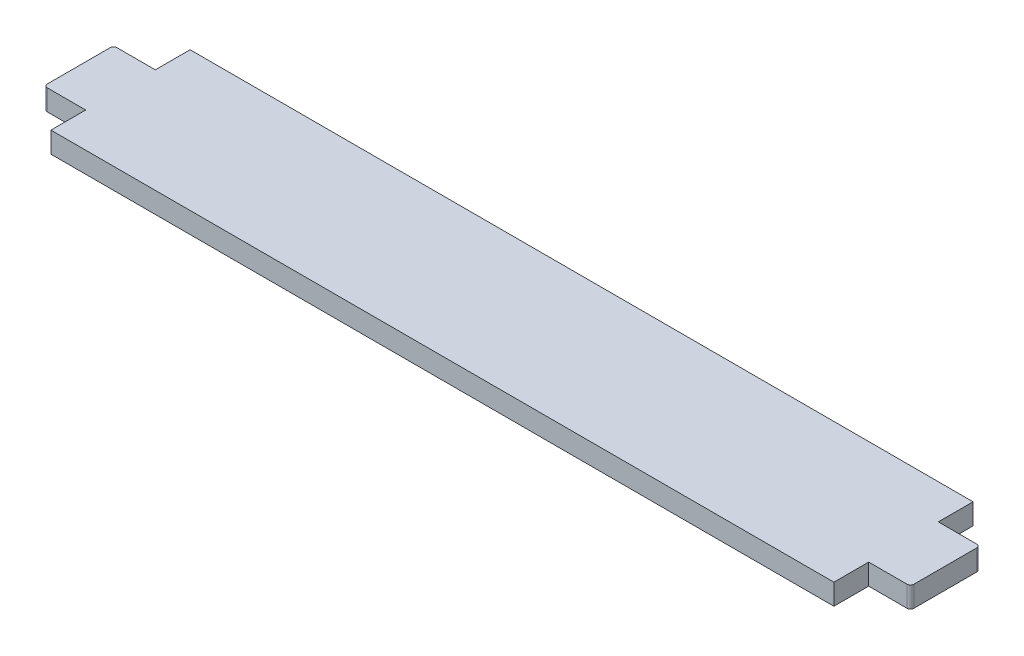
ISO-10303-21;
HEADER;
FILE_DESCRIPTION(('STEP AP214'),'2;1');
FILE_NAME('part.step','',(''),(''),'','','');
FILE_SCHEMA(('AUTOMOTIVE_DESIGN { 1 0 10303 214 1 1 1 1 }'));
ENDSEC;
DATA;
#1=APPLICATION_CONTEXT('core data for automotive mechanical design processes');
#2=APPLICATION_PROTOCOL_DEFINITION('international standard','automotive_design',2000,#1);
#3=PRODUCT_CONTEXT('',#1,'mechanical');
#4=PRODUCT('Part','Part','',(#3));
#5=PRODUCT_RELATED_PRODUCT_CATEGORY('part','',(#4));
#6=PRODUCT_DEFINITION_FORMATION('','',#4);
#7=PRODUCT_DEFINITION_CONTEXT('part definition',#1,'design');
#8=PRODUCT_DEFINITION('design','',#6,#7);
#9=PRODUCT_DEFINITION_SHAPE('','',#8);
#10=(LENGTH_UNIT() NAMED_UNIT(*) SI_UNIT(.MILLI.,.METRE.));
#11=(NAMED_UNIT(*) PLANE_ANGLE_UNIT() SI_UNIT($,.RADIAN.));
#12=(NAMED_UNIT(*) SI_UNIT($,.STERADIAN.) SOLID_ANGLE_UNIT());
#13=UNCERTAINTY_MEASURE_WITH_UNIT(LENGTH_MEASURE(1.E-05),#10,'distance_accuracy_value','');
#14=(GEOMETRIC_REPRESENTATION_CONTEXT(3) GLOBAL_UNCERTAINTY_ASSIGNED_CONTEXT((#13)) GLOBAL_UNIT_ASSIGNED_CONTEXT((#10,
#11,#12)) REPRESENTATION_CONTEXT('',''));
#15=CARTESIAN_POINT('',(0.,0.,0.));
#16=DIRECTION('',(0.,0.,1.));
#17=DIRECTION('',(1.,0.,0.));
#18=AXIS2_PLACEMENT_3D('',#15,#16,#17);
#19=CARTESIAN_POINT('',(0.,3.,4.99999999999999));
#20=DIRECTION('',(0.,0.,1.));
#21=DIRECTION('',(1.,0.,0.));
#22=AXIS2_PLACEMENT_3D('',#19,#20,#21);
#23=PLANE('',#22);
#24=DIRECTION('',(-1.,0.,0.));
#25=VECTOR('',#24,1.);
#26=CARTESIAN_POINT('',(0.,3.,4.99999999999999));
#27=LINE('',#26,#25);
#28=CARTESIAN_POINT('',(-56.25,3.,4.99999999999999));
#29=VERTEX_POINT('',#28);
#30=CARTESIAN_POINT('',(-61.75,3.,4.99999999999999));
#31=VERTEX_POINT('',#30);
#32=EDGE_CURVE('E162',#29,#31,#27,.T.);
#33=ORIENTED_EDGE('',*,*,#32,.T.);
#34=DIRECTION('',(0.,-1.,0.));
#35=VECTOR('',#34,1.);
#36=CARTESIAN_POINT('',(-61.75,0.,4.99999999999999));
#37=LINE('',#36,#35);
#38=CARTESIAN_POINT('',(-61.75,0.,4.99999999999999));
#39=VERTEX_POINT('',#38);
#40=EDGE_CURVE('E305',#31,#39,#37,.T.);
#41=ORIENTED_EDGE('',*,*,#40,.T.);
#42=DIRECTION('',(-1.,0.,0.));
#43=VECTOR('',#42,1.);
#44=CARTESIAN_POINT('',(0.,0.,4.99999999999999));
#45=LINE('',#44,#43);
#46=CARTESIAN_POINT('',(-56.25,0.,4.99999999999999));
#47=VERTEX_POINT('',#46);
#48=EDGE_CURVE('E165',#47,#39,#45,.T.);
#49=ORIENTED_EDGE('',*,*,#48,.F.);
#50=DIRECTION('',(0.,-1.,0.));
#51=VECTOR('',#50,1.);
#52=CARTESIAN_POINT('',(-56.25,3.,4.99999999999999));
#53=LINE('',#52,#51);
#54=EDGE_CURVE('E158',#29,#47,#53,.T.);
#55=ORIENTED_EDGE('',*,*,#54,.F.);
#56=EDGE_LOOP('',(#33,#41,#49,#55));
#57=FACE_BOUND('',#56,.T.);
#58=ADVANCED_FACE('F43',(#57),#23,.T.);
#59=CARTESIAN_POINT('',(-56.25,3.,0.));
#60=DIRECTION('',(1.,0.,0.));
#61=DIRECTION('',(0.,0.,-1.));
#62=AXIS2_PLACEMENT_3D('',#59,#60,#61);
#63=PLANE('',#62);
#64=DIRECTION('',(0.,0.,1.));
#65=VECTOR('',#64,1.);
#66=CARTESIAN_POINT('',(-56.25,0.,0.));
#67=LINE('',#66,#65);
#68=CARTESIAN_POINT('',(-56.25,0.,10.));
#69=VERTEX_POINT('',#68);
#70=EDGE_CURVE('E223',#47,#69,#67,.T.);
#71=ORIENTED_EDGE('',*,*,#70,.T.);
#72=DIRECTION('',(0.,-1.,0.));
#73=VECTOR('',#72,1.);
#74=CARTESIAN_POINT('',(-56.25,3.,10.));
#75=LINE('',#74,#73);
#76=CARTESIAN_POINT('',(-56.25,3.,10.));
#77=VERTEX_POINT('',#76);
#78=EDGE_CURVE('E170',#77,#69,#75,.T.);
#79=ORIENTED_EDGE('',*,*,#78,.F.);
#80=DIRECTION('',(0.,0.,1.));
#81=VECTOR('',#80,1.);
#82=CARTESIAN_POINT('',(-56.25,3.,0.));
#83=LINE('',#82,#81);
#84=EDGE_CURVE('E173',#29,#77,#83,.T.);
#85=ORIENTED_EDGE('',*,*,#84,.F.);
#86=ORIENTED_EDGE('',*,*,#54,.T.);
#87=EDGE_LOOP('',(#71,#79,#85,#86));
#88=FACE_BOUND('',#87,.T.);
#89=ADVANCED_FACE('F174',(#88),#63,.F.);
#90=CARTESIAN_POINT('',(0.,3.,10.));
#91=DIRECTION('',(0.,0.,-1.));
#92=DIRECTION('',(-1.,0.,0.));
#93=AXIS2_PLACEMENT_3D('',#90,#91,#92);
#94=PLANE('',#93);
#95=DIRECTION('',(1.,0.,0.));
#96=VECTOR('',#95,1.);
#97=CARTESIAN_POINT('',(0.,0.,10.));
#98=LINE('',#97,#96);
#99=CARTESIAN_POINT('',(56.25,0.,10.));
#100=VERTEX_POINT('',#99);
#101=EDGE_CURVE('E226',#69,#100,#98,.T.);
#102=ORIENTED_EDGE('',*,*,#101,.T.);
#103=DIRECTION('',(0.,-1.,0.));
#104=VECTOR('',#103,1.);
#105=CARTESIAN_POINT('',(56.25,3.,10.));
#106=LINE('',#105,#104);
#107=CARTESIAN_POINT('',(56.25,3.,10.));
#108=VERTEX_POINT('',#107);
#109=EDGE_CURVE('E270',#108,#100,#106,.T.);
#110=ORIENTED_EDGE('',*,*,#109,.F.);
#111=DIRECTION('',(1.,0.,0.));
#112=VECTOR('',#111,1.);
#113=CARTESIAN_POINT('',(0.,3.,10.));
#114=LINE('',#113,#112);
#115=EDGE_CURVE('E178',#77,#108,#114,.T.);
#116=ORIENTED_EDGE('',*,*,#115,.F.);
#117=ORIENTED_EDGE('',*,*,#78,.T.);
#118=EDGE_LOOP('',(#102,#110,#116,#117));
#119=FACE_BOUND('',#118,.T.);
#120=ADVANCED_FACE('F358',(#119),#94,.F.);
#121=CARTESIAN_POINT('',(56.25,3.,0.));
#122=DIRECTION('',(1.,0.,0.));
#123=DIRECTION('',(0.,0.,-1.));
#124=AXIS2_PLACEMENT_3D('',#121,#122,#123);
#125=PLANE('',#124);
#126=DIRECTION('',(0.,0.,1.));
#127=VECTOR('',#126,1.);
#128=CARTESIAN_POINT('',(56.25,0.,0.));
#129=LINE('',#128,#127);
#130=CARTESIAN_POINT('',(56.25,0.,4.99999999999999));
#131=VERTEX_POINT('',#130);
#132=EDGE_CURVE('E231',#131,#100,#129,.T.);
#133=ORIENTED_EDGE('',*,*,#132,.F.);
#134=DIRECTION('',(0.,-1.,0.));
#135=VECTOR('',#134,1.);
#136=CARTESIAN_POINT('',(56.25,3.,4.99999999999999));
#137=LINE('',#136,#135);
#138=CARTESIAN_POINT('',(56.25,3.,4.99999999999999));
#139=VERTEX_POINT('',#138);
#140=EDGE_CURVE('E267',#139,#131,#137,.T.);
#141=ORIENTED_EDGE('',*,*,#140,.F.);
#142=DIRECTION('',(0.,0.,1.));
#143=VECTOR('',#142,1.);
#144=CARTESIAN_POINT('',(56.25,3.,0.));
#145=LINE('',#144,#143);
#146=EDGE_CURVE('E196',#139,#108,#145,.T.);
#147=ORIENTED_EDGE('',*,*,#146,.T.);
#148=ORIENTED_EDGE('',*,*,#109,.T.);
#149=EDGE_LOOP('',(#133,#141,#147,#148));
#150=FACE_BOUND('',#149,.T.);
#151=ADVANCED_FACE('F364',(#150),#125,.T.);
#152=CARTESIAN_POINT('',(0.,3.,4.99999999999999));
#153=DIRECTION('',(0.,0.,-1.));
#154=DIRECTION('',(-1.,0.,0.));
#155=AXIS2_PLACEMENT_3D('',#152,#153,#154);
#156=PLANE('',#155);
#157=DIRECTION('',(1.,0.,0.));
#158=VECTOR('',#157,1.);
#159=CARTESIAN_POINT('',(0.,0.,4.99999999999999));
#160=LINE('',#159,#158);
#161=CARTESIAN_POINT('',(61.75,0.,4.99999999999999));
#162=VERTEX_POINT('',#161);
#163=EDGE_CURVE('E235',#131,#162,#160,.T.);
#164=ORIENTED_EDGE('',*,*,#163,.T.);
#165=DIRECTION('',(0.,-1.,0.));
#166=VECTOR('',#165,1.);
#167=CARTESIAN_POINT('',(61.75,3.,4.99999999999999));
#168=LINE('',#167,#166);
#169=CARTESIAN_POINT('',(61.75,3.,4.99999999999999));
#170=VERTEX_POINT('',#169);
#171=EDGE_CURVE('E11',#162,#170,#168,.F.);
#172=ORIENTED_EDGE('',*,*,#171,.T.);
#173=DIRECTION('',(1.,0.,0.));
#174=VECTOR('',#173,1.);
#175=CARTESIAN_POINT('',(0.,3.,4.99999999999999));
#176=LINE('',#175,#174);
#177=EDGE_CURVE('E200',#139,#170,#176,.T.);
#178=ORIENTED_EDGE('',*,*,#177,.F.);
#179=ORIENTED_EDGE('',*,*,#140,.T.);
#180=EDGE_LOOP('',(#164,#172,#178,#179));
#181=FACE_BOUND('',#180,.T.);
#182=ADVANCED_FACE('F367',(#181),#156,.F.);
#183=CARTESIAN_POINT('',(62.25,3.,0.));
#184=DIRECTION('',(1.,0.,0.));
#185=DIRECTION('',(0.,0.,-1.));
#186=AXIS2_PLACEMENT_3D('',#183,#184,#185);
#187=PLANE('',#186);
#188=DIRECTION('',(0.,0.,1.));
#189=VECTOR('',#188,1.);
#190=CARTESIAN_POINT('',(62.25,0.,0.));
#191=LINE('',#190,#189);
#192=CARTESIAN_POINT('',(62.25,0.,-4.50000000000001));
#193=VERTEX_POINT('',#192);
#194=CARTESIAN_POINT('',(62.25,0.,4.5));
#195=VERTEX_POINT('',#194);
#196=EDGE_CURVE('E240',#193,#195,#191,.T.);
#197=ORIENTED_EDGE('',*,*,#196,.F.);
#198=DIRECTION('',(0.,-1.,0.));
#199=VECTOR('',#198,1.);
#200=CARTESIAN_POINT('',(62.25,3.,-4.50000000000001));
#201=LINE('',#200,#199);
#202=CARTESIAN_POINT('',(62.25,3.,-4.50000000000001));
#203=VERTEX_POINT('',#202);
#204=EDGE_CURVE('E52',#193,#203,#201,.F.);
#205=ORIENTED_EDGE('',*,*,#204,.T.);
#206=DIRECTION('',(0.,0.,1.));
#207=VECTOR('',#206,1.);
#208=CARTESIAN_POINT('',(62.25,3.,0.));
#209=LINE('',#208,#207);
#210=CARTESIAN_POINT('',(62.25,3.,4.5));
#211=VERTEX_POINT('',#210);
#212=EDGE_CURVE('E204',#203,#211,#209,.T.);
#213=ORIENTED_EDGE('',*,*,#212,.T.);
#214=DIRECTION('',(0.,-1.,0.));
#215=VECTOR('',#214,1.);
#216=CARTESIAN_POINT('',(62.25,0.,4.5));
#217=LINE('',#216,#215);
#218=EDGE_CURVE('E312',#211,#195,#217,.T.);
#219=ORIENTED_EDGE('',*,*,#218,.T.);
#220=EDGE_LOOP('',(#197,#205,#213,#219));
#221=FACE_BOUND('',#220,.T.);
#222=ADVANCED_FACE('F319',(#221),#187,.T.);
#223=CARTESIAN_POINT('',(0.,3.,-5.00000000000001));
#224=DIRECTION('',(0.,0.,-1.));
#225=DIRECTION('',(-1.,0.,0.));
#226=AXIS2_PLACEMENT_3D('',#223,#224,#225);
#227=PLANE('',#226);
#228=DIRECTION('',(1.,0.,0.));
#229=VECTOR('',#228,1.);
#230=CARTESIAN_POINT('',(0.,3.,-5.00000000000001));
#231=LINE('',#230,#229);
#232=CARTESIAN_POINT('',(56.25,3.,-5.00000000000001));
#233=VERTEX_POINT('',#232);
#234=CARTESIAN_POINT('',(61.75,3.,-5.00000000000001));
#235=VERTEX_POINT('',#234);
#236=EDGE_CURVE('E207',#233,#235,#231,.T.);
#237=ORIENTED_EDGE('',*,*,#236,.T.);
#238=DIRECTION('',(0.,-1.,0.));
#239=VECTOR('',#238,1.);
#240=CARTESIAN_POINT('',(61.75,3.,-5.00000000000001));
#241=LINE('',#240,#239);
#242=CARTESIAN_POINT('',(61.75,0.,-5.00000000000001));
#243=VERTEX_POINT('',#242);
#244=EDGE_CURVE('E308',#235,#243,#241,.T.);
#245=ORIENTED_EDGE('',*,*,#244,.T.);
#246=DIRECTION('',(1.,0.,0.));
#247=VECTOR('',#246,1.);
#248=CARTESIAN_POINT('',(0.,0.,-5.00000000000001));
#249=LINE('',#248,#247);
#250=CARTESIAN_POINT('',(56.25,0.,-5.00000000000001));
#251=VERTEX_POINT('',#250);
#252=EDGE_CURVE('E244',#251,#243,#249,.T.);
#253=ORIENTED_EDGE('',*,*,#252,.F.);
#254=DIRECTION('',(0.,-1.,0.));
#255=VECTOR('',#254,1.);
#256=CARTESIAN_POINT('',(56.25,3.,-5.00000000000001));
#257=LINE('',#256,#255);
#258=EDGE_CURVE('E264',#233,#251,#257,.T.);
#259=ORIENTED_EDGE('',*,*,#258,.F.);
#260=EDGE_LOOP('',(#237,#245,#253,#259));
#261=FACE_BOUND('',#260,.T.);
#262=ADVANCED_FACE('F326',(#261),#227,.T.);
#263=CARTESIAN_POINT('',(56.25,0.,-10.));
#264=VERTEX_POINT('',#263);
#265=EDGE_CURVE('E236',#264,#251,#129,.T.);
#266=ORIENTED_EDGE('',*,*,#265,.F.);
#267=DIRECTION('',(0.,-1.,0.));
#268=VECTOR('',#267,1.);
#269=CARTESIAN_POINT('',(56.25,3.,-10.));
#270=LINE('',#269,#268);
#271=CARTESIAN_POINT('',(56.25,3.,-10.));
#272=VERTEX_POINT('',#271);
#273=EDGE_CURVE('E261',#272,#264,#270,.T.);
#274=ORIENTED_EDGE('',*,*,#273,.F.);
#275=EDGE_CURVE('E201',#272,#233,#145,.T.);
#276=ORIENTED_EDGE('',*,*,#275,.T.);
#277=ORIENTED_EDGE('',*,*,#258,.T.);
#278=EDGE_LOOP('',(#266,#274,#276,#277));
#279=FACE_BOUND('',#278,.T.);
#280=ADVANCED_FACE('F453',(#279),#125,.T.);
#281=CARTESIAN_POINT('',(0.,3.,-10.));
#282=DIRECTION('',(0.,0.,-1.));
#283=DIRECTION('',(-1.,0.,0.));
#284=AXIS2_PLACEMENT_3D('',#281,#282,#283);
#285=PLANE('',#284);
#286=DIRECTION('',(1.,0.,0.));
#287=VECTOR('',#286,1.);
#288=CARTESIAN_POINT('',(0.,0.,-10.));
#289=LINE('',#288,#287);
#290=CARTESIAN_POINT('',(-56.25,0.,-10.));
#291=VERTEX_POINT('',#290);
#292=EDGE_CURVE('E248',#291,#264,#289,.T.);
#293=ORIENTED_EDGE('',*,*,#292,.F.);
#294=DIRECTION('',(0.,-1.,0.));
#295=VECTOR('',#294,1.);
#296=CARTESIAN_POINT('',(-56.25,3.,-10.));
#297=LINE('',#296,#295);
#298=CARTESIAN_POINT('',(-56.25,3.,-10.));
#299=VERTEX_POINT('',#298);
#300=EDGE_CURVE('E258',#299,#291,#297,.T.);
#301=ORIENTED_EDGE('',*,*,#300,.F.);
#302=DIRECTION('',(1.,0.,0.));
#303=VECTOR('',#302,1.);
#304=CARTESIAN_POINT('',(0.,3.,-10.));
#305=LINE('',#304,#303);
#306=EDGE_CURVE('E210',#299,#272,#305,.T.);
#307=ORIENTED_EDGE('',*,*,#306,.T.);
#308=ORIENTED_EDGE('',*,*,#273,.T.);
#309=EDGE_LOOP('',(#293,#301,#307,#308));
#310=FACE_BOUND('',#309,.T.);
#311=ADVANCED_FACE('F484',(#310),#285,.T.);
#312=CARTESIAN_POINT('',(-56.25,0.,-5.00000000000001));
#313=VERTEX_POINT('',#312);
#314=EDGE_CURVE('E227',#291,#313,#67,.T.);
#315=ORIENTED_EDGE('',*,*,#314,.T.);
#316=DIRECTION('',(0.,-1.,0.));
#317=VECTOR('',#316,1.);
#318=CARTESIAN_POINT('',(-56.25,3.,-5.00000000000001));
#319=LINE('',#318,#317);
#320=CARTESIAN_POINT('',(-56.25,3.,-5.00000000000001));
#321=VERTEX_POINT('',#320);
#322=EDGE_CURVE('E220',#321,#313,#319,.T.);
#323=ORIENTED_EDGE('',*,*,#322,.F.);
#324=EDGE_CURVE('E180',#299,#321,#83,.T.);
#325=ORIENTED_EDGE('',*,*,#324,.F.);
#326=ORIENTED_EDGE('',*,*,#300,.T.);
#327=EDGE_LOOP('',(#315,#323,#325,#326));
#328=FACE_BOUND('',#327,.T.);
#329=ADVANCED_FACE('F339',(#328),#63,.F.);
#330=CARTESIAN_POINT('',(0.,3.,-5.00000000000001));
#331=DIRECTION('',(0.,0.,1.));
#332=DIRECTION('',(1.,0.,0.));
#333=AXIS2_PLACEMENT_3D('',#330,#331,#332);
#334=PLANE('',#333);
#335=DIRECTION('',(-1.,0.,0.));
#336=VECTOR('',#335,1.);
#337=CARTESIAN_POINT('',(0.,0.,-5.00000000000001));
#338=LINE('',#337,#336);
#339=CARTESIAN_POINT('',(-61.75,0.,-5.00000000000001));
#340=VERTEX_POINT('',#339);
#341=EDGE_CURVE('E191',#313,#340,#338,.T.);
#342=ORIENTED_EDGE('',*,*,#341,.T.);
#343=DIRECTION('',(0.,-1.,0.));
#344=VECTOR('',#343,1.);
#345=CARTESIAN_POINT('',(-61.75,3.,-5.00000000000001));
#346=LINE('',#345,#344);
#347=CARTESIAN_POINT('',(-61.75,3.,-5.00000000000001));
#348=VERTEX_POINT('',#347);
#349=EDGE_CURVE('E293',#340,#348,#346,.F.);
#350=ORIENTED_EDGE('',*,*,#349,.T.);
#351=DIRECTION('',(-1.,0.,0.));
#352=VECTOR('',#351,1.);
#353=CARTESIAN_POINT('',(0.,3.,-5.00000000000001));
#354=LINE('',#353,#352);
#355=EDGE_CURVE('E214',#321,#348,#354,.T.);
#356=ORIENTED_EDGE('',*,*,#355,.F.);
#357=ORIENTED_EDGE('',*,*,#322,.T.);
#358=EDGE_LOOP('',(#342,#350,#356,#357));
#359=FACE_BOUND('',#358,.T.);
#360=ADVANCED_FACE('F344',(#359),#334,.F.);
#361=CARTESIAN_POINT('',(-62.25,3.,0.));
#362=DIRECTION('',(1.,0.,0.));
#363=DIRECTION('',(0.,0.,-1.));
#364=AXIS2_PLACEMENT_3D('',#361,#362,#363);
#365=PLANE('',#364);
#366=DIRECTION('',(0.,0.,1.));
#367=VECTOR('',#366,1.);
#368=CARTESIAN_POINT('',(-62.25,3.,0.));
#369=LINE('',#368,#367);
#370=CARTESIAN_POINT('',(-62.25,3.,-4.50000000000001));
#371=VERTEX_POINT('',#370);
#372=CARTESIAN_POINT('',(-62.25,3.,4.5));
#373=VERTEX_POINT('',#372);
#374=EDGE_CURVE('E217',#371,#373,#369,.T.);
#375=ORIENTED_EDGE('',*,*,#374,.F.);
#376=DIRECTION('',(0.,-1.,0.));
#377=VECTOR('',#376,1.);
#378=CARTESIAN_POINT('',(-62.25,3.,-4.50000000000001));
#379=LINE('',#378,#377);
#380=CARTESIAN_POINT('',(-62.25,0.,-4.50000000000001));
#381=VERTEX_POINT('',#380);
#382=EDGE_CURVE('E277',#371,#381,#379,.T.);
#383=ORIENTED_EDGE('',*,*,#382,.T.);
#384=DIRECTION('',(0.,0.,1.));
#385=VECTOR('',#384,1.);
#386=CARTESIAN_POINT('',(-62.25,0.,0.));
#387=LINE('',#386,#385);
#388=CARTESIAN_POINT('',(-62.25,0.,4.5));
#389=VERTEX_POINT('',#388);
#390=EDGE_CURVE('E187',#381,#389,#387,.T.);
#391=ORIENTED_EDGE('',*,*,#390,.T.);
#392=DIRECTION('',(0.,-1.,0.));
#393=VECTOR('',#392,1.);
#394=CARTESIAN_POINT('',(-62.25,3.,4.5));
#395=LINE('',#394,#393);
#396=EDGE_CURVE('E169',#389,#373,#395,.F.);
#397=ORIENTED_EDGE('',*,*,#396,.T.);
#398=EDGE_LOOP('',(#375,#383,#391,#397));
#399=FACE_BOUND('',#398,.T.);
#400=ADVANCED_FACE('F352',(#399),#365,.F.);
#401=CARTESIAN_POINT('',(0.,3.,0.));
#402=DIRECTION('',(0.,1.,0.));
#403=DIRECTION('',(0.,0.,1.));
#404=AXIS2_PLACEMENT_3D('',#401,#402,#403);
#405=PLANE('',#404);
#406=ORIENTED_EDGE('',*,*,#355,.T.);
#407=CARTESIAN_POINT('',(-61.75,3.,-4.50000000000001));
#408=DIRECTION('',(0.,1.,0.));
#409=DIRECTION('',(0.,0.,1.));
#410=AXIS2_PLACEMENT_3D('',#407,#408,#409);
#411=CIRCLE('',#410,0.5);
#412=EDGE_CURVE('E302',#348,#371,#411,.T.);
#413=ORIENTED_EDGE('',*,*,#412,.T.);
#414=ORIENTED_EDGE('',*,*,#374,.T.);
#415=CARTESIAN_POINT('',(-61.75,3.,4.5));
#416=DIRECTION('',(0.,1.,0.));
#417=DIRECTION('',(0.,0.,1.));
#418=AXIS2_PLACEMENT_3D('',#415,#416,#417);
#419=CIRCLE('',#418,0.5);
#420=EDGE_CURVE('E185',#373,#31,#419,.T.);
#421=ORIENTED_EDGE('',*,*,#420,.T.);
#422=ORIENTED_EDGE('',*,*,#32,.F.);
#423=ORIENTED_EDGE('',*,*,#84,.T.);
#424=ORIENTED_EDGE('',*,*,#115,.T.);
#425=ORIENTED_EDGE('',*,*,#146,.F.);
#426=ORIENTED_EDGE('',*,*,#177,.T.);
#427=CARTESIAN_POINT('',(61.75,3.,4.5));
#428=DIRECTION('',(0.,1.,0.));
#429=DIRECTION('',(0.,0.,1.));
#430=AXIS2_PLACEMENT_3D('',#427,#428,#429);
#431=CIRCLE('',#430,0.5);
#432=EDGE_CURVE('E65',#170,#211,#431,.T.);
#433=ORIENTED_EDGE('',*,*,#432,.T.);
#434=ORIENTED_EDGE('',*,*,#212,.F.);
#435=CARTESIAN_POINT('',(61.75,3.,-4.50000000000001));
#436=DIRECTION('',(0.,1.,0.));
#437=DIRECTION('',(0.,0.,1.));
#438=AXIS2_PLACEMENT_3D('',#435,#436,#437);
#439=CIRCLE('',#438,0.5);
#440=EDGE_CURVE('E59',#203,#235,#439,.T.);
#441=ORIENTED_EDGE('',*,*,#440,.T.);
#442=ORIENTED_EDGE('',*,*,#236,.F.);
#443=ORIENTED_EDGE('',*,*,#275,.F.);
#444=ORIENTED_EDGE('',*,*,#306,.F.);
#445=ORIENTED_EDGE('',*,*,#324,.T.);
#446=EDGE_LOOP('',(#406,#413,#414,#421,#422,#423,#424,#425,#426,#433,#434,#441,#442,#443,#444,#445));
#447=FACE_BOUND('',#446,.T.);
#448=ADVANCED_FACE('F182',(#447),#405,.T.);
#449=CARTESIAN_POINT('',(0.,0.,0.));
#450=DIRECTION('',(0.,1.,0.));
#451=DIRECTION('',(0.,0.,1.));
#452=AXIS2_PLACEMENT_3D('',#449,#450,#451);
#453=PLANE('',#452);
#454=ORIENTED_EDGE('',*,*,#390,.F.);
#455=CARTESIAN_POINT('',(-61.75,0.,-4.50000000000001));
#456=DIRECTION('',(0.,1.,0.));
#457=DIRECTION('',(0.,0.,1.));
#458=AXIS2_PLACEMENT_3D('',#455,#456,#457);
#459=CIRCLE('',#458,0.5);
#460=EDGE_CURVE('E290',#381,#340,#459,.F.);
#461=ORIENTED_EDGE('',*,*,#460,.T.);
#462=ORIENTED_EDGE('',*,*,#341,.F.);
#463=ORIENTED_EDGE('',*,*,#314,.F.);
#464=ORIENTED_EDGE('',*,*,#292,.T.);
#465=ORIENTED_EDGE('',*,*,#265,.T.);
#466=ORIENTED_EDGE('',*,*,#252,.T.);
#467=CARTESIAN_POINT('',(61.75,0.,-4.50000000000001));
#468=DIRECTION('',(0.,1.,0.));
#469=DIRECTION('',(0.,0.,1.));
#470=AXIS2_PLACEMENT_3D('',#467,#468,#469);
#471=CIRCLE('',#470,0.5);
#472=EDGE_CURVE('E284',#243,#193,#471,.F.);
#473=ORIENTED_EDGE('',*,*,#472,.T.);
#474=ORIENTED_EDGE('',*,*,#196,.T.);
#475=CARTESIAN_POINT('',(61.75,0.,4.5));
#476=DIRECTION('',(0.,1.,0.));
#477=DIRECTION('',(0.,0.,1.));
#478=AXIS2_PLACEMENT_3D('',#475,#476,#477);
#479=CIRCLE('',#478,0.5);
#480=EDGE_CURVE('E281',#195,#162,#479,.F.);
#481=ORIENTED_EDGE('',*,*,#480,.T.);
#482=ORIENTED_EDGE('',*,*,#163,.F.);
#483=ORIENTED_EDGE('',*,*,#132,.T.);
#484=ORIENTED_EDGE('',*,*,#101,.F.);
#485=ORIENTED_EDGE('',*,*,#70,.F.);
#486=ORIENTED_EDGE('',*,*,#48,.T.);
#487=CARTESIAN_POINT('',(-61.75,0.,4.5));
#488=DIRECTION('',(0.,1.,0.));
#489=DIRECTION('',(0.,0.,1.));
#490=AXIS2_PLACEMENT_3D('',#487,#488,#489);
#491=CIRCLE('',#490,0.5);
#492=EDGE_CURVE('E287',#39,#389,#491,.F.);
#493=ORIENTED_EDGE('',*,*,#492,.T.);
#494=EDGE_LOOP('',(#454,#461,#462,#463,#464,#465,#466,#473,#474,#481,#482,#483,#484,#485,#486,#493));
#495=FACE_BOUND('',#494,.T.);
#496=ADVANCED_FACE('F330',(#495),#453,.F.);
#497=CARTESIAN_POINT('',(-61.75,3.,-4.50000000000001));
#498=DIRECTION('',(0.,-1.,0.));
#499=DIRECTION('',(0.,0.,-1.));
#500=AXIS2_PLACEMENT_3D('',#497,#498,#499);
#501=CYLINDRICAL_SURFACE('',#500,0.5);
#502=ORIENTED_EDGE('',*,*,#412,.F.);
#503=ORIENTED_EDGE('',*,*,#349,.F.);
#504=ORIENTED_EDGE('',*,*,#460,.F.);
#505=ORIENTED_EDGE('',*,*,#382,.F.);
#506=EDGE_LOOP('',(#502,#503,#504,#505));
#507=FACE_BOUND('',#506,.T.);
#508=ADVANCED_FACE('F349',(#507),#501,.T.);
#509=CARTESIAN_POINT('',(-61.75,3.,4.5));
#510=DIRECTION('',(0.,1.,0.));
#511=DIRECTION('',(0.,0.,1.));
#512=AXIS2_PLACEMENT_3D('',#509,#510,#511);
#513=CYLINDRICAL_SURFACE('',#512,0.5);
#514=ORIENTED_EDGE('',*,*,#420,.F.);
#515=ORIENTED_EDGE('',*,*,#396,.F.);
#516=ORIENTED_EDGE('',*,*,#492,.F.);
#517=ORIENTED_EDGE('',*,*,#40,.F.);
#518=EDGE_LOOP('',(#514,#515,#516,#517));
#519=FACE_BOUND('',#518,.T.);
#520=ADVANCED_FACE('F355',(#519),#513,.T.);
#521=CARTESIAN_POINT('',(61.75,3.,-4.50000000000001));
#522=DIRECTION('',(0.,-1.,0.));
#523=DIRECTION('',(0.,0.,-1.));
#524=AXIS2_PLACEMENT_3D('',#521,#522,#523);
#525=CYLINDRICAL_SURFACE('',#524,0.5);
#526=ORIENTED_EDGE('',*,*,#440,.F.);
#527=ORIENTED_EDGE('',*,*,#204,.F.);
#528=ORIENTED_EDGE('',*,*,#472,.F.);
#529=ORIENTED_EDGE('',*,*,#244,.F.);
#530=EDGE_LOOP('',(#526,#527,#528,#529));
#531=FACE_BOUND('',#530,.T.);
#532=ADVANCED_FACE('F323',(#531),#525,.T.);
#533=CARTESIAN_POINT('',(61.75,3.,4.5));
#534=DIRECTION('',(0.,1.,0.));
#535=DIRECTION('',(0.,0.,1.));
#536=AXIS2_PLACEMENT_3D('',#533,#534,#535);
#537=CYLINDRICAL_SURFACE('',#536,0.5);
#538=ORIENTED_EDGE('',*,*,#432,.F.);
#539=ORIENTED_EDGE('',*,*,#171,.F.);
#540=ORIENTED_EDGE('',*,*,#480,.F.);
#541=ORIENTED_EDGE('',*,*,#218,.F.);
#542=EDGE_LOOP('',(#538,#539,#540,#541));
#543=FACE_BOUND('',#542,.T.);
#544=ADVANCED_FACE('F45',(#543),#537,.T.);
#545=CLOSED_SHELL('',(#58,#89,#120,#151,#182,#222,#262,#280,#311,#329,#360,#400,#448,#496,#508,
#520,#532,#544));
#546=MANIFOLD_SOLID_BREP('B2',#545);
#547=ADVANCED_BREP_SHAPE_REPRESENTATION('',(#18,#546),#14);
#548=SHAPE_DEFINITION_REPRESENTATION(#9,#547);
ENDSEC;
END-ISO-10303-21;
